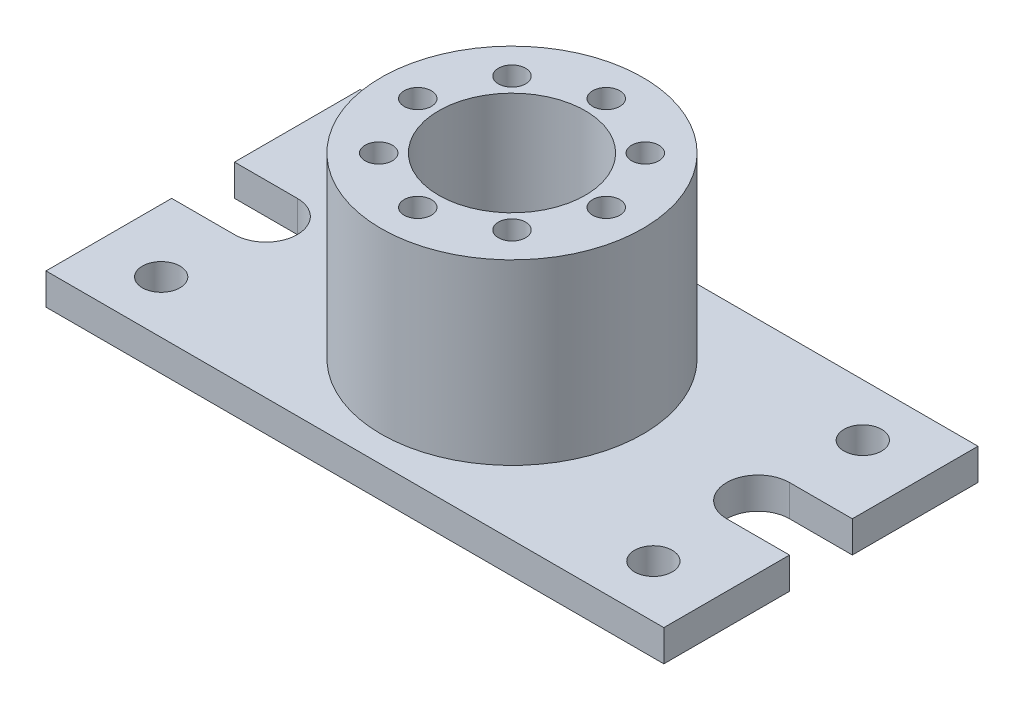
ISO-10303-21;
HEADER;
FILE_DESCRIPTION(('STEP AP214'),'2;1');
FILE_NAME('part.step','',(''),(''),'','','');
FILE_SCHEMA(('AUTOMOTIVE_DESIGN { 1 0 10303 214 1 1 1 1 }'));
ENDSEC;
DATA;
#1=APPLICATION_CONTEXT('core data for automotive mechanical design processes');
#2=APPLICATION_PROTOCOL_DEFINITION('international standard','automotive_design',2000,#1);
#3=PRODUCT_CONTEXT('',#1,'mechanical');
#4=PRODUCT('Part','Part','',(#3));
#5=PRODUCT_RELATED_PRODUCT_CATEGORY('part','',(#4));
#6=PRODUCT_DEFINITION_FORMATION('','',#4);
#7=PRODUCT_DEFINITION_CONTEXT('part definition',#1,'design');
#8=PRODUCT_DEFINITION('design','',#6,#7);
#9=PRODUCT_DEFINITION_SHAPE('','',#8);
#10=(LENGTH_UNIT() NAMED_UNIT(*) SI_UNIT(.MILLI.,.METRE.));
#11=(NAMED_UNIT(*) PLANE_ANGLE_UNIT() SI_UNIT($,.RADIAN.));
#12=(NAMED_UNIT(*) SI_UNIT($,.STERADIAN.) SOLID_ANGLE_UNIT());
#13=UNCERTAINTY_MEASURE_WITH_UNIT(LENGTH_MEASURE(1.E-05),#10,'distance_accuracy_value','');
#14=(GEOMETRIC_REPRESENTATION_CONTEXT(3) GLOBAL_UNCERTAINTY_ASSIGNED_CONTEXT((#13)) GLOBAL_UNIT_ASSIGNED_CONTEXT((#10,
#11,#12)) REPRESENTATION_CONTEXT('',''));
#15=CARTESIAN_POINT('',(0.,0.,0.));
#16=DIRECTION('',(0.,0.,1.));
#17=DIRECTION('',(1.,0.,0.));
#18=AXIS2_PLACEMENT_3D('',#15,#16,#17);
#19=CARTESIAN_POINT('',(0.,15.,14.9999999999998));
#20=DIRECTION('',(0.,0.,-1.));
#21=DIRECTION('',(-1.,0.,0.));
#22=AXIS2_PLACEMENT_3D('',#19,#20,#21);
#23=PLANE('',#22);
#24=DIRECTION('',(1.,0.,0.));
#25=VECTOR('',#24,1.);
#26=CARTESIAN_POINT('',(0.,0.,14.9999999999998));
#27=LINE('',#26,#25);
#28=CARTESIAN_POINT('',(117.5,0.,15.));
#29=VERTEX_POINT('',#28);
#30=CARTESIAN_POINT('',(147.5,0.,15.));
#31=VERTEX_POINT('',#30);
#32=EDGE_CURVE('E168',#29,#31,#27,.T.);
#33=ORIENTED_EDGE('',*,*,#32,.F.);
#34=DIRECTION('',(0.,-1.,0.));
#35=VECTOR('',#34,1.);
#36=CARTESIAN_POINT('',(117.5,15.,15.));
#37=LINE('',#36,#35);
#38=CARTESIAN_POINT('',(117.5,15.,15.));
#39=VERTEX_POINT('',#38);
#40=EDGE_CURVE('E11',#39,#29,#37,.T.);
#41=ORIENTED_EDGE('',*,*,#40,.F.);
#42=DIRECTION('',(1.,0.,0.));
#43=VECTOR('',#42,1.);
#44=CARTESIAN_POINT('',(0.,15.,14.9999999999998));
#45=LINE('',#44,#43);
#46=CARTESIAN_POINT('',(147.5,15.,15.));
#47=VERTEX_POINT('',#46);
#48=EDGE_CURVE('E334',#39,#47,#45,.T.);
#49=ORIENTED_EDGE('',*,*,#48,.T.);
#50=DIRECTION('',(0.,-1.,0.));
#51=VECTOR('',#50,1.);
#52=CARTESIAN_POINT('',(147.5,15.,15.));
#53=LINE('',#52,#51);
#54=EDGE_CURVE('E97',#47,#31,#53,.T.);
#55=ORIENTED_EDGE('',*,*,#54,.T.);
#56=EDGE_LOOP('',(#33,#41,#49,#55));
#57=FACE_BOUND('',#56,.T.);
#58=ADVANCED_FACE('F33',(#57),#23,.T.);
#59=CARTESIAN_POINT('',(117.5,15.,0.));
#60=DIRECTION('',(0.,-1.,0.));
#61=DIRECTION('',(0.,0.,-1.));
#62=AXIS2_PLACEMENT_3D('',#59,#60,#61);
#63=CYLINDRICAL_SURFACE('',#62,15.);
#64=CARTESIAN_POINT('',(117.5,0.,0.));
#65=DIRECTION('',(0.,1.,0.));
#66=DIRECTION('',(0.,0.,1.));
#67=AXIS2_PLACEMENT_3D('',#64,#65,#66);
#68=CIRCLE('',#67,15.);
#69=CARTESIAN_POINT('',(117.5,0.,-15.));
#70=VERTEX_POINT('',#69);
#71=EDGE_CURVE('E170',#29,#70,#68,.F.);
#72=ORIENTED_EDGE('',*,*,#71,.T.);
#73=DIRECTION('',(0.,-1.,0.));
#74=VECTOR('',#73,1.);
#75=CARTESIAN_POINT('',(117.5,15.,-15.));
#76=LINE('',#75,#74);
#77=CARTESIAN_POINT('',(117.5,15.,-15.));
#78=VERTEX_POINT('',#77);
#79=EDGE_CURVE('E42',#78,#70,#76,.T.);
#80=ORIENTED_EDGE('',*,*,#79,.F.);
#81=CARTESIAN_POINT('',(117.5,15.,0.));
#82=DIRECTION('',(0.,1.,0.));
#83=DIRECTION('',(0.,0.,1.));
#84=AXIS2_PLACEMENT_3D('',#81,#82,#83);
#85=CIRCLE('',#84,15.);
#86=EDGE_CURVE('E332',#39,#78,#85,.F.);
#87=ORIENTED_EDGE('',*,*,#86,.F.);
#88=ORIENTED_EDGE('',*,*,#40,.T.);
#89=EDGE_LOOP('',(#72,#80,#87,#88));
#90=FACE_BOUND('',#89,.T.);
#91=ADVANCED_FACE('F222',(#90),#63,.F.);
#92=CARTESIAN_POINT('',(0.,15.,-15.0000000000001));
#93=DIRECTION('',(0.,0.,-1.));
#94=DIRECTION('',(-1.,0.,0.));
#95=AXIS2_PLACEMENT_3D('',#92,#93,#94);
#96=PLANE('',#95);
#97=DIRECTION('',(1.,0.,0.));
#98=VECTOR('',#97,1.);
#99=CARTESIAN_POINT('',(0.,0.,-15.0000000000001));
#100=LINE('',#99,#98);
#101=CARTESIAN_POINT('',(147.5,0.,-15.));
#102=VERTEX_POINT('',#101);
#103=EDGE_CURVE('E173',#70,#102,#100,.T.);
#104=ORIENTED_EDGE('',*,*,#103,.T.);
#105=DIRECTION('',(0.,-1.,0.));
#106=VECTOR('',#105,1.);
#107=CARTESIAN_POINT('',(147.5,15.,-15.));
#108=LINE('',#107,#106);
#109=CARTESIAN_POINT('',(147.5,15.,-15.));
#110=VERTEX_POINT('',#109);
#111=EDGE_CURVE('E210',#110,#102,#108,.T.);
#112=ORIENTED_EDGE('',*,*,#111,.F.);
#113=DIRECTION('',(1.,0.,0.));
#114=VECTOR('',#113,1.);
#115=CARTESIAN_POINT('',(0.,15.,-15.0000000000001));
#116=LINE('',#115,#114);
#117=EDGE_CURVE('E218',#78,#110,#116,.T.);
#118=ORIENTED_EDGE('',*,*,#117,.F.);
#119=ORIENTED_EDGE('',*,*,#79,.T.);
#120=EDGE_LOOP('',(#104,#112,#118,#119));
#121=FACE_BOUND('',#120,.T.);
#122=ADVANCED_FACE('F215',(#121),#96,.F.);
#123=CARTESIAN_POINT('',(147.5,15.,0.));
#124=DIRECTION('',(-1.,0.,0.));
#125=DIRECTION('',(0.,0.,1.));
#126=AXIS2_PLACEMENT_3D('',#123,#124,#125);
#127=PLANE('',#126);
#128=DIRECTION('',(0.,0.,-1.));
#129=VECTOR('',#128,1.);
#130=CARTESIAN_POINT('',(147.5,0.,0.));
#131=LINE('',#130,#129);
#132=CARTESIAN_POINT('',(147.5,0.,-75.));
#133=VERTEX_POINT('',#132);
#134=EDGE_CURVE('E176',#102,#133,#131,.T.);
#135=ORIENTED_EDGE('',*,*,#134,.T.);
#136=DIRECTION('',(0.,-1.,0.));
#137=VECTOR('',#136,1.);
#138=CARTESIAN_POINT('',(147.5,15.,-75.));
#139=LINE('',#138,#137);
#140=CARTESIAN_POINT('',(147.5,15.,-75.));
#141=VERTEX_POINT('',#140);
#142=EDGE_CURVE('E208',#141,#133,#139,.T.);
#143=ORIENTED_EDGE('',*,*,#142,.F.);
#144=DIRECTION('',(0.,0.,-1.));
#145=VECTOR('',#144,1.);
#146=CARTESIAN_POINT('',(147.5,15.,0.));
#147=LINE('',#146,#145);
#148=EDGE_CURVE('E318',#110,#141,#147,.T.);
#149=ORIENTED_EDGE('',*,*,#148,.F.);
#150=ORIENTED_EDGE('',*,*,#111,.T.);
#151=EDGE_LOOP('',(#135,#143,#149,#150));
#152=FACE_BOUND('',#151,.T.);
#153=ADVANCED_FACE('F278',(#152),#127,.F.);
#154=CARTESIAN_POINT('',(0.,15.,-75.));
#155=DIRECTION('',(0.,0.,-1.));
#156=DIRECTION('',(-1.,0.,0.));
#157=AXIS2_PLACEMENT_3D('',#154,#155,#156);
#158=PLANE('',#157);
#159=DIRECTION('',(1.,0.,0.));
#160=VECTOR('',#159,1.);
#161=CARTESIAN_POINT('',(0.,0.,-75.));
#162=LINE('',#161,#160);
#163=CARTESIAN_POINT('',(-147.5,0.,-75.));
#164=VERTEX_POINT('',#163);
#165=EDGE_CURVE('E179',#164,#133,#162,.T.);
#166=ORIENTED_EDGE('',*,*,#165,.F.);
#167=DIRECTION('',(0.,-1.,0.));
#168=VECTOR('',#167,1.);
#169=CARTESIAN_POINT('',(-147.5,15.,-75.));
#170=LINE('',#169,#168);
#171=CARTESIAN_POINT('',(-147.5,15.,-75.));
#172=VERTEX_POINT('',#171);
#173=EDGE_CURVE('E206',#172,#164,#170,.T.);
#174=ORIENTED_EDGE('',*,*,#173,.F.);
#175=DIRECTION('',(1.,0.,0.));
#176=VECTOR('',#175,1.);
#177=CARTESIAN_POINT('',(0.,15.,-75.));
#178=LINE('',#177,#176);
#179=EDGE_CURVE('E314',#172,#141,#178,.T.);
#180=ORIENTED_EDGE('',*,*,#179,.T.);
#181=ORIENTED_EDGE('',*,*,#142,.T.);
#182=EDGE_LOOP('',(#166,#174,#180,#181));
#183=FACE_BOUND('',#182,.T.);
#184=ADVANCED_FACE('F298',(#183),#158,.T.);
#185=CARTESIAN_POINT('',(-147.5,15.,0.));
#186=DIRECTION('',(-1.,0.,0.));
#187=DIRECTION('',(0.,0.,1.));
#188=AXIS2_PLACEMENT_3D('',#185,#186,#187);
#189=PLANE('',#188);
#190=DIRECTION('',(0.,0.,-1.));
#191=VECTOR('',#190,1.);
#192=CARTESIAN_POINT('',(-147.5,0.,0.));
#193=LINE('',#192,#191);
#194=CARTESIAN_POINT('',(-147.5,0.,-15.));
#195=VERTEX_POINT('',#194);
#196=EDGE_CURVE('E182',#195,#164,#193,.T.);
#197=ORIENTED_EDGE('',*,*,#196,.F.);
#198=DIRECTION('',(0.,-1.,0.));
#199=VECTOR('',#198,1.);
#200=CARTESIAN_POINT('',(-147.5,15.,-15.));
#201=LINE('',#200,#199);
#202=CARTESIAN_POINT('',(-147.5,15.,-15.));
#203=VERTEX_POINT('',#202);
#204=EDGE_CURVE('E204',#203,#195,#201,.T.);
#205=ORIENTED_EDGE('',*,*,#204,.F.);
#206=DIRECTION('',(0.,0.,-1.));
#207=VECTOR('',#206,1.);
#208=CARTESIAN_POINT('',(-147.5,15.,0.));
#209=LINE('',#208,#207);
#210=EDGE_CURVE('E317',#203,#172,#209,.T.);
#211=ORIENTED_EDGE('',*,*,#210,.T.);
#212=ORIENTED_EDGE('',*,*,#173,.T.);
#213=EDGE_LOOP('',(#197,#205,#211,#212));
#214=FACE_BOUND('',#213,.T.);
#215=ADVANCED_FACE('F294',(#214),#189,.T.);
#216=CARTESIAN_POINT('',(0.,15.,-15.));
#217=DIRECTION('',(0.,0.,1.));
#218=DIRECTION('',(1.,0.,0.));
#219=AXIS2_PLACEMENT_3D('',#216,#217,#218);
#220=PLANE('',#219);
#221=DIRECTION('',(-1.,0.,0.));
#222=VECTOR('',#221,1.);
#223=CARTESIAN_POINT('',(0.,0.,-15.));
#224=LINE('',#223,#222);
#225=CARTESIAN_POINT('',(-117.5,0.,-15.));
#226=VERTEX_POINT('',#225);
#227=EDGE_CURVE('E185',#226,#195,#224,.T.);
#228=ORIENTED_EDGE('',*,*,#227,.F.);
#229=DIRECTION('',(0.,-1.,0.));
#230=VECTOR('',#229,1.);
#231=CARTESIAN_POINT('',(-117.5,15.,-15.));
#232=LINE('',#231,#230);
#233=CARTESIAN_POINT('',(-117.5,15.,-15.));
#234=VERTEX_POINT('',#233);
#235=EDGE_CURVE('E202',#234,#226,#232,.T.);
#236=ORIENTED_EDGE('',*,*,#235,.F.);
#237=DIRECTION('',(-1.,0.,0.));
#238=VECTOR('',#237,1.);
#239=CARTESIAN_POINT('',(0.,15.,-15.));
#240=LINE('',#239,#238);
#241=EDGE_CURVE('E320',#234,#203,#240,.T.);
#242=ORIENTED_EDGE('',*,*,#241,.T.);
#243=ORIENTED_EDGE('',*,*,#204,.T.);
#244=EDGE_LOOP('',(#228,#236,#242,#243));
#245=FACE_BOUND('',#244,.T.);
#246=ADVANCED_FACE('F290',(#245),#220,.T.);
#247=CARTESIAN_POINT('',(-117.5,15.,0.));
#248=DIRECTION('',(0.,-1.,0.));
#249=DIRECTION('',(0.,0.,-1.));
#250=AXIS2_PLACEMENT_3D('',#247,#248,#249);
#251=CYLINDRICAL_SURFACE('',#250,15.);
#252=CARTESIAN_POINT('',(-117.5,0.,0.));
#253=DIRECTION('',(0.,1.,0.));
#254=DIRECTION('',(0.,0.,1.));
#255=AXIS2_PLACEMENT_3D('',#252,#253,#254);
#256=CIRCLE('',#255,15.);
#257=CARTESIAN_POINT('',(-117.5,0.,15.));
#258=VERTEX_POINT('',#257);
#259=EDGE_CURVE('E188',#258,#226,#256,.T.);
#260=ORIENTED_EDGE('',*,*,#259,.F.);
#261=DIRECTION('',(0.,-1.,0.));
#262=VECTOR('',#261,1.);
#263=CARTESIAN_POINT('',(-117.5,15.,15.));
#264=LINE('',#263,#262);
#265=CARTESIAN_POINT('',(-117.5,15.,15.));
#266=VERTEX_POINT('',#265);
#267=EDGE_CURVE('E200',#266,#258,#264,.T.);
#268=ORIENTED_EDGE('',*,*,#267,.F.);
#269=CARTESIAN_POINT('',(-117.5,15.,0.));
#270=DIRECTION('',(0.,1.,0.));
#271=DIRECTION('',(0.,0.,1.));
#272=AXIS2_PLACEMENT_3D('',#269,#270,#271);
#273=CIRCLE('',#272,15.);
#274=EDGE_CURVE('E151',#266,#234,#273,.T.);
#275=ORIENTED_EDGE('',*,*,#274,.T.);
#276=ORIENTED_EDGE('',*,*,#235,.T.);
#277=EDGE_LOOP('',(#260,#268,#275,#276));
#278=FACE_BOUND('',#277,.T.);
#279=ADVANCED_FACE('F286',(#278),#251,.F.);
#280=CARTESIAN_POINT('',(0.,15.,15.));
#281=DIRECTION('',(0.,0.,1.));
#282=DIRECTION('',(1.,0.,0.));
#283=AXIS2_PLACEMENT_3D('',#280,#281,#282);
#284=PLANE('',#283);
#285=DIRECTION('',(-1.,0.,0.));
#286=VECTOR('',#285,1.);
#287=CARTESIAN_POINT('',(0.,0.,15.));
#288=LINE('',#287,#286);
#289=CARTESIAN_POINT('',(-147.5,0.,15.));
#290=VERTEX_POINT('',#289);
#291=EDGE_CURVE('E191',#258,#290,#288,.T.);
#292=ORIENTED_EDGE('',*,*,#291,.T.);
#293=DIRECTION('',(0.,-1.,0.));
#294=VECTOR('',#293,1.);
#295=CARTESIAN_POINT('',(-147.5,15.,15.));
#296=LINE('',#295,#294);
#297=CARTESIAN_POINT('',(-147.5,15.,15.));
#298=VERTEX_POINT('',#297);
#299=EDGE_CURVE('E138',#298,#290,#296,.T.);
#300=ORIENTED_EDGE('',*,*,#299,.F.);
#301=DIRECTION('',(-1.,0.,0.));
#302=VECTOR('',#301,1.);
#303=CARTESIAN_POINT('',(0.,15.,15.));
#304=LINE('',#303,#302);
#305=EDGE_CURVE('E148',#266,#298,#304,.T.);
#306=ORIENTED_EDGE('',*,*,#305,.F.);
#307=ORIENTED_EDGE('',*,*,#267,.T.);
#308=EDGE_LOOP('',(#292,#300,#306,#307));
#309=FACE_BOUND('',#308,.T.);
#310=ADVANCED_FACE('F283',(#309),#284,.F.);
#311=CARTESIAN_POINT('',(-147.5,15.,0.));
#312=DIRECTION('',(-1.,0.,0.));
#313=DIRECTION('',(0.,0.,1.));
#314=AXIS2_PLACEMENT_3D('',#311,#312,#313);
#315=PLANE('',#314);
#316=DIRECTION('',(0.,0.,-1.));
#317=VECTOR('',#316,1.);
#318=CARTESIAN_POINT('',(-147.5,0.,0.));
#319=LINE('',#318,#317);
#320=CARTESIAN_POINT('',(-147.5,0.,75.));
#321=VERTEX_POINT('',#320);
#322=EDGE_CURVE('E135',#321,#290,#319,.T.);
#323=ORIENTED_EDGE('',*,*,#322,.F.);
#324=DIRECTION('',(0.,-1.,0.));
#325=VECTOR('',#324,1.);
#326=CARTESIAN_POINT('',(-147.5,15.,75.));
#327=LINE('',#326,#325);
#328=CARTESIAN_POINT('',(-147.5,15.,75.));
#329=VERTEX_POINT('',#328);
#330=EDGE_CURVE('E129',#329,#321,#327,.T.);
#331=ORIENTED_EDGE('',*,*,#330,.F.);
#332=DIRECTION('',(0.,0.,-1.));
#333=VECTOR('',#332,1.);
#334=CARTESIAN_POINT('',(-147.5,15.,0.));
#335=LINE('',#334,#333);
#336=EDGE_CURVE('E133',#329,#298,#335,.T.);
#337=ORIENTED_EDGE('',*,*,#336,.T.);
#338=ORIENTED_EDGE('',*,*,#299,.T.);
#339=EDGE_LOOP('',(#323,#331,#337,#338));
#340=FACE_BOUND('',#339,.T.);
#341=ADVANCED_FACE('F131',(#340),#315,.T.);
#342=CARTESIAN_POINT('',(0.,15.,75.));
#343=DIRECTION('',(0.,0.,-1.));
#344=DIRECTION('',(-1.,0.,0.));
#345=AXIS2_PLACEMENT_3D('',#342,#343,#344);
#346=PLANE('',#345);
#347=DIRECTION('',(1.,0.,0.));
#348=VECTOR('',#347,1.);
#349=CARTESIAN_POINT('',(0.,0.,75.));
#350=LINE('',#349,#348);
#351=CARTESIAN_POINT('',(147.5,0.,75.));
#352=VERTEX_POINT('',#351);
#353=EDGE_CURVE('E195',#321,#352,#350,.T.);
#354=ORIENTED_EDGE('',*,*,#353,.T.);
#355=DIRECTION('',(0.,-1.,0.));
#356=VECTOR('',#355,1.);
#357=CARTESIAN_POINT('',(147.5,15.,75.));
#358=LINE('',#357,#356);
#359=CARTESIAN_POINT('',(147.5,15.,75.));
#360=VERTEX_POINT('',#359);
#361=EDGE_CURVE('E139',#360,#352,#358,.T.);
#362=ORIENTED_EDGE('',*,*,#361,.F.);
#363=DIRECTION('',(1.,0.,0.));
#364=VECTOR('',#363,1.);
#365=CARTESIAN_POINT('',(0.,15.,75.));
#366=LINE('',#365,#364);
#367=EDGE_CURVE('E142',#329,#360,#366,.T.);
#368=ORIENTED_EDGE('',*,*,#367,.F.);
#369=ORIENTED_EDGE('',*,*,#330,.T.);
#370=EDGE_LOOP('',(#354,#362,#368,#369));
#371=FACE_BOUND('',#370,.T.);
#372=ADVANCED_FACE('F143',(#371),#346,.F.);
#373=CARTESIAN_POINT('',(-117.5,15.,50.));
#374=DIRECTION('',(0.,-1.,0.));
#375=DIRECTION('',(0.,0.,-1.));
#376=AXIS2_PLACEMENT_3D('',#373,#374,#375);
#377=CYLINDRICAL_SURFACE('',#376,9.);
#378=CARTESIAN_POINT('',(-117.5,15.,50.));
#379=DIRECTION('',(0.,1.,0.));
#380=DIRECTION('',(0.,0.,1.));
#381=AXIS2_PLACEMENT_3D('',#378,#379,#380);
#382=CIRCLE('',#381,9.);
#383=CARTESIAN_POINT('',(-117.5,15.,59.));
#384=VERTEX_POINT('',#383);
#385=EDGE_CURVE('E336',#384,#384,#382,.F.);
#386=ORIENTED_EDGE('',*,*,#385,.F.);
#387=EDGE_LOOP('',(#386));
#388=FACE_BOUND('',#387,.T.);
#389=CARTESIAN_POINT('',(-117.5,0.,50.));
#390=DIRECTION('',(0.,1.,0.));
#391=DIRECTION('',(0.,0.,1.));
#392=AXIS2_PLACEMENT_3D('',#389,#390,#391);
#393=CIRCLE('',#392,9.);
#394=CARTESIAN_POINT('',(-117.5,0.,59.));
#395=VERTEX_POINT('',#394);
#396=EDGE_CURVE('E165',#395,#395,#393,.F.);
#397=ORIENTED_EDGE('',*,*,#396,.T.);
#398=EDGE_LOOP('',(#397));
#399=FACE_BOUND('',#398,.T.);
#400=ADVANCED_FACE('F232',(#388,#399),#377,.F.);
#401=CARTESIAN_POINT('',(117.5,15.,50.));
#402=DIRECTION('',(0.,-1.,0.));
#403=DIRECTION('',(0.,0.,-1.));
#404=AXIS2_PLACEMENT_3D('',#401,#402,#403);
#405=CYLINDRICAL_SURFACE('',#404,9.00000000000001);
#406=CARTESIAN_POINT('',(117.5,15.,50.));
#407=DIRECTION('',(0.,1.,0.));
#408=DIRECTION('',(0.,0.,1.));
#409=AXIS2_PLACEMENT_3D('',#406,#407,#408);
#410=CIRCLE('',#409,9.00000000000001);
#411=CARTESIAN_POINT('',(117.5,15.,59.));
#412=VERTEX_POINT('',#411);
#413=EDGE_CURVE('E339',#412,#412,#410,.T.);
#414=ORIENTED_EDGE('',*,*,#413,.T.);
#415=EDGE_LOOP('',(#414));
#416=FACE_BOUND('',#415,.T.);
#417=CARTESIAN_POINT('',(117.5,0.,50.));
#418=DIRECTION('',(0.,1.,0.));
#419=DIRECTION('',(0.,0.,1.));
#420=AXIS2_PLACEMENT_3D('',#417,#418,#419);
#421=CIRCLE('',#420,9.00000000000001);
#422=CARTESIAN_POINT('',(117.5,0.,59.));
#423=VERTEX_POINT('',#422);
#424=EDGE_CURVE('E162',#423,#423,#421,.T.);
#425=ORIENTED_EDGE('',*,*,#424,.F.);
#426=EDGE_LOOP('',(#425));
#427=FACE_BOUND('',#426,.T.);
#428=ADVANCED_FACE('F235',(#416,#427),#405,.F.);
#429=CARTESIAN_POINT('',(-117.5,15.,-50.));
#430=DIRECTION('',(0.,-1.,0.));
#431=DIRECTION('',(0.,0.,-1.));
#432=AXIS2_PLACEMENT_3D('',#429,#430,#431);
#433=CYLINDRICAL_SURFACE('',#432,9.);
#434=CARTESIAN_POINT('',(-117.5,15.,-50.));
#435=DIRECTION('',(0.,1.,0.));
#436=DIRECTION('',(0.,0.,1.));
#437=AXIS2_PLACEMENT_3D('',#434,#435,#436);
#438=CIRCLE('',#437,9.);
#439=CARTESIAN_POINT('',(-117.5,15.,-41.));
#440=VERTEX_POINT('',#439);
#441=EDGE_CURVE('E250',#440,#440,#438,.T.);
#442=ORIENTED_EDGE('',*,*,#441,.T.);
#443=EDGE_LOOP('',(#442));
#444=FACE_BOUND('',#443,.T.);
#445=CARTESIAN_POINT('',(-117.5,0.,-50.));
#446=DIRECTION('',(0.,1.,0.));
#447=DIRECTION('',(0.,0.,1.));
#448=AXIS2_PLACEMENT_3D('',#445,#446,#447);
#449=CIRCLE('',#448,9.);
#450=CARTESIAN_POINT('',(-117.5,0.,-41.));
#451=VERTEX_POINT('',#450);
#452=EDGE_CURVE('E158',#451,#451,#449,.T.);
#453=ORIENTED_EDGE('',*,*,#452,.F.);
#454=EDGE_LOOP('',(#453));
#455=FACE_BOUND('',#454,.T.);
#456=ADVANCED_FACE('F238',(#444,#455),#433,.F.);
#457=CARTESIAN_POINT('',(117.5,15.,-50.));
#458=DIRECTION('',(0.,-1.,0.));
#459=DIRECTION('',(0.,0.,-1.));
#460=AXIS2_PLACEMENT_3D('',#457,#458,#459);
#461=CYLINDRICAL_SURFACE('',#460,9.00000000000001);
#462=CARTESIAN_POINT('',(117.5,15.,-50.));
#463=DIRECTION('',(0.,1.,0.));
#464=DIRECTION('',(0.,0.,1.));
#465=AXIS2_PLACEMENT_3D('',#462,#463,#464);
#466=CIRCLE('',#465,9.00000000000001);
#467=CARTESIAN_POINT('',(117.5,15.,-41.));
#468=VERTEX_POINT('',#467);
#469=EDGE_CURVE('E343',#468,#468,#466,.F.);
#470=ORIENTED_EDGE('',*,*,#469,.F.);
#471=EDGE_LOOP('',(#470));
#472=FACE_BOUND('',#471,.T.);
#473=CARTESIAN_POINT('',(117.5,0.,-50.));
#474=DIRECTION('',(0.,1.,0.));
#475=DIRECTION('',(0.,0.,1.));
#476=AXIS2_PLACEMENT_3D('',#473,#474,#475);
#477=CIRCLE('',#476,9.00000000000001);
#478=CARTESIAN_POINT('',(117.5,0.,-41.));
#479=VERTEX_POINT('',#478);
#480=EDGE_CURVE('E155',#479,#479,#477,.F.);
#481=ORIENTED_EDGE('',*,*,#480,.T.);
#482=EDGE_LOOP('',(#481));
#483=FACE_BOUND('',#482,.T.);
#484=ADVANCED_FACE('F35',(#472,#483),#461,.F.);
#485=EDGE_CURVE('E90',#352,#31,#131,.T.);
#486=ORIENTED_EDGE('',*,*,#485,.T.);
#487=ORIENTED_EDGE('',*,*,#54,.F.);
#488=EDGE_CURVE('E50',#360,#47,#147,.T.);
#489=ORIENTED_EDGE('',*,*,#488,.F.);
#490=ORIENTED_EDGE('',*,*,#361,.T.);
#491=EDGE_LOOP('',(#486,#487,#489,#490));
#492=FACE_BOUND('',#491,.T.);
#493=ADVANCED_FACE('F245',(#492),#127,.F.);
#494=CARTESIAN_POINT('',(0.,15.,0.));
#495=DIRECTION('',(0.,1.,0.));
#496=DIRECTION('',(0.,0.,1.));
#497=AXIS2_PLACEMENT_3D('',#494,#495,#496);
#498=PLANE('',#497);
#499=CARTESIAN_POINT('',(0.,15.,0.));
#500=DIRECTION('',(0.,1.,0.));
#501=DIRECTION('',(0.,0.,1.));
#502=AXIS2_PLACEMENT_3D('',#499,#500,#501);
#503=CIRCLE('',#502,62.5);
#504=CARTESIAN_POINT('',(0.,15.,62.5));
#505=VERTEX_POINT('',#504);
#506=EDGE_CURVE('E346',#505,#505,#503,.T.);
#507=ORIENTED_EDGE('',*,*,#506,.F.);
#508=EDGE_LOOP('',(#507));
#509=FACE_BOUND('',#508,.T.);
#510=ORIENTED_EDGE('',*,*,#469,.T.);
#511=EDGE_LOOP('',(#510));
#512=FACE_BOUND('',#511,.T.);
#513=ORIENTED_EDGE('',*,*,#441,.F.);
#514=EDGE_LOOP('',(#513));
#515=FACE_BOUND('',#514,.T.);
#516=ORIENTED_EDGE('',*,*,#413,.F.);
#517=EDGE_LOOP('',(#516));
#518=FACE_BOUND('',#517,.T.);
#519=ORIENTED_EDGE('',*,*,#385,.T.);
#520=EDGE_LOOP('',(#519));
#521=FACE_BOUND('',#520,.T.);
#522=ORIENTED_EDGE('',*,*,#48,.F.);
#523=ORIENTED_EDGE('',*,*,#86,.T.);
#524=ORIENTED_EDGE('',*,*,#117,.T.);
#525=ORIENTED_EDGE('',*,*,#148,.T.);
#526=ORIENTED_EDGE('',*,*,#179,.F.);
#527=ORIENTED_EDGE('',*,*,#210,.F.);
#528=ORIENTED_EDGE('',*,*,#241,.F.);
#529=ORIENTED_EDGE('',*,*,#274,.F.);
#530=ORIENTED_EDGE('',*,*,#305,.T.);
#531=ORIENTED_EDGE('',*,*,#336,.F.);
#532=ORIENTED_EDGE('',*,*,#367,.T.);
#533=ORIENTED_EDGE('',*,*,#488,.T.);
#534=EDGE_LOOP('',(#522,#523,#524,#525,#526,#527,#528,#529,#530,#531,#532,#533));
#535=FACE_BOUND('',#534,.T.);
#536=ADVANCED_FACE('F145',(#509,#512,#515,#518,#521,#535),#498,.T.);
#537=CARTESIAN_POINT('',(0.,0.,0.));
#538=DIRECTION('',(0.,1.,0.));
#539=DIRECTION('',(0.,0.,1.));
#540=AXIS2_PLACEMENT_3D('',#537,#538,#539);
#541=PLANE('',#540);
#542=CARTESIAN_POINT('',(0.,0.,0.));
#543=DIRECTION('',(0.,1.,0.));
#544=DIRECTION('',(0.,0.,1.));
#545=AXIS2_PLACEMENT_3D('',#542,#543,#544);
#546=CIRCLE('',#545,35.);
#547=CARTESIAN_POINT('',(0.,0.,35.));
#548=VERTEX_POINT('',#547);
#549=EDGE_CURVE('E349',#548,#548,#546,.T.);
#550=ORIENTED_EDGE('',*,*,#549,.T.);
#551=EDGE_LOOP('',(#550));
#552=FACE_BOUND('',#551,.T.);
#553=ORIENTED_EDGE('',*,*,#480,.F.);
#554=EDGE_LOOP('',(#553));
#555=FACE_BOUND('',#554,.T.);
#556=ORIENTED_EDGE('',*,*,#452,.T.);
#557=EDGE_LOOP('',(#556));
#558=FACE_BOUND('',#557,.T.);
#559=ORIENTED_EDGE('',*,*,#424,.T.);
#560=EDGE_LOOP('',(#559));
#561=FACE_BOUND('',#560,.T.);
#562=ORIENTED_EDGE('',*,*,#396,.F.);
#563=EDGE_LOOP('',(#562));
#564=FACE_BOUND('',#563,.T.);
#565=ORIENTED_EDGE('',*,*,#32,.T.);
#566=ORIENTED_EDGE('',*,*,#485,.F.);
#567=ORIENTED_EDGE('',*,*,#353,.F.);
#568=ORIENTED_EDGE('',*,*,#322,.T.);
#569=ORIENTED_EDGE('',*,*,#291,.F.);
#570=ORIENTED_EDGE('',*,*,#259,.T.);
#571=ORIENTED_EDGE('',*,*,#227,.T.);
#572=ORIENTED_EDGE('',*,*,#196,.T.);
#573=ORIENTED_EDGE('',*,*,#165,.T.);
#574=ORIENTED_EDGE('',*,*,#134,.F.);
#575=ORIENTED_EDGE('',*,*,#103,.F.);
#576=ORIENTED_EDGE('',*,*,#71,.F.);
#577=EDGE_LOOP('',(#565,#566,#567,#568,#569,#570,#571,#572,#573,#574,#575,#576));
#578=FACE_BOUND('',#577,.T.);
#579=ADVANCED_FACE('F223',(#552,#555,#558,#561,#564,#578),#541,.F.);
#580=CARTESIAN_POINT('',(0.,100.,0.));
#581=DIRECTION('',(0.,-1.,0.));
#582=DIRECTION('',(0.,0.,-1.));
#583=AXIS2_PLACEMENT_3D('',#580,#581,#582);
#584=CYLINDRICAL_SURFACE('',#583,62.5);
#585=CARTESIAN_POINT('',(0.,100.,0.));
#586=DIRECTION('',(0.,1.,0.));
#587=DIRECTION('',(0.,0.,1.));
#588=AXIS2_PLACEMENT_3D('',#585,#586,#587);
#589=CIRCLE('',#588,62.5);
#590=CARTESIAN_POINT('',(0.,100.,62.5));
#591=VERTEX_POINT('',#590);
#592=EDGE_CURVE('E159',#591,#591,#589,.T.);
#593=ORIENTED_EDGE('',*,*,#592,.F.);
#594=EDGE_LOOP('',(#593));
#595=FACE_BOUND('',#594,.T.);
#596=ORIENTED_EDGE('',*,*,#506,.T.);
#597=EDGE_LOOP('',(#596));
#598=FACE_BOUND('',#597,.T.);
#599=ADVANCED_FACE('F255',(#595,#598),#584,.T.);
#600=CARTESIAN_POINT('',(0.,100.,0.));
#601=DIRECTION('',(0.,1.,0.));
#602=DIRECTION('',(0.,0.,1.));
#603=AXIS2_PLACEMENT_3D('',#600,#601,#602);
#604=PLANE('',#603);
#605=CARTESIAN_POINT('',(-31.8198051533946,100.,-31.8198051533947));
#606=DIRECTION('',(0.,1.,0.));
#607=DIRECTION('',(0.,0.,1.));
#608=AXIS2_PLACEMENT_3D('',#605,#606,#607);
#609=CIRCLE('',#608,6.5);
#610=CARTESIAN_POINT('',(-31.8198051533946,100.,-25.3198051533947));
#611=VERTEX_POINT('',#610);
#612=EDGE_CURVE('E399',#611,#611,#609,.T.);
#613=ORIENTED_EDGE('',*,*,#612,.F.);
#614=EDGE_LOOP('',(#613));
#615=FACE_BOUND('',#614,.T.);
#616=CARTESIAN_POINT('',(1.57116660247941E-13,100.,-45.));
#617=DIRECTION('',(0.,1.,0.));
#618=DIRECTION('',(0.,0.,1.));
#619=AXIS2_PLACEMENT_3D('',#616,#617,#618);
#620=CIRCLE('',#619,6.5);
#621=CARTESIAN_POINT('',(1.57116660247941E-13,100.,-38.5));
#622=VERTEX_POINT('',#621);
#623=EDGE_CURVE('E393',#622,#622,#620,.T.);
#624=ORIENTED_EDGE('',*,*,#623,.F.);
#625=EDGE_LOOP('',(#624));
#626=FACE_BOUND('',#625,.T.);
#627=CARTESIAN_POINT('',(31.8198051533948,100.,-31.8198051533945));
#628=DIRECTION('',(0.,1.,0.));
#629=DIRECTION('',(0.,0.,1.));
#630=AXIS2_PLACEMENT_3D('',#627,#628,#629);
#631=CIRCLE('',#630,6.5);
#632=CARTESIAN_POINT('',(31.8198051533948,100.,-25.3198051533945));
#633=VERTEX_POINT('',#632);
#634=EDGE_CURVE('E387',#633,#633,#631,.T.);
#635=ORIENTED_EDGE('',*,*,#634,.F.);
#636=EDGE_LOOP('',(#635));
#637=FACE_BOUND('',#636,.T.);
#638=CARTESIAN_POINT('',(45.,100.,3.14233320495882E-13));
#639=DIRECTION('',(0.,1.,0.));
#640=DIRECTION('',(0.,0.,1.));
#641=AXIS2_PLACEMENT_3D('',#638,#639,#640);
#642=CIRCLE('',#641,6.5);
#643=CARTESIAN_POINT('',(45.,100.,6.50000000000032));
#644=VERTEX_POINT('',#643);
#645=EDGE_CURVE('E381',#644,#644,#642,.T.);
#646=ORIENTED_EDGE('',*,*,#645,.F.);
#647=EDGE_LOOP('',(#646));
#648=FACE_BOUND('',#647,.T.);
#649=CARTESIAN_POINT('',(31.8198051533944,100.,31.8198051533949));
#650=DIRECTION('',(0.,1.,0.));
#651=DIRECTION('',(0.,0.,1.));
#652=AXIS2_PLACEMENT_3D('',#649,#650,#651);
#653=CIRCLE('',#652,6.50000000000001);
#654=CARTESIAN_POINT('',(31.8198051533944,100.,38.3198051533949));
#655=VERTEX_POINT('',#654);
#656=EDGE_CURVE('E375',#655,#655,#653,.T.);
#657=ORIENTED_EDGE('',*,*,#656,.F.);
#658=EDGE_LOOP('',(#657));
#659=FACE_BOUND('',#658,.T.);
#660=CARTESIAN_POINT('',(-4.71349980743823E-13,100.,45.));
#661=DIRECTION('',(0.,1.,0.));
#662=DIRECTION('',(0.,0.,1.));
#663=AXIS2_PLACEMENT_3D('',#660,#661,#662);
#664=CIRCLE('',#663,6.5);
#665=CARTESIAN_POINT('',(-4.71349980743823E-13,100.,51.5));
#666=VERTEX_POINT('',#665);
#667=EDGE_CURVE('E369',#666,#666,#664,.T.);
#668=ORIENTED_EDGE('',*,*,#667,.F.);
#669=EDGE_LOOP('',(#668));
#670=FACE_BOUND('',#669,.T.);
#671=CARTESIAN_POINT('',(-31.819805153395,100.,31.8198051533942));
#672=DIRECTION('',(0.,1.,0.));
#673=DIRECTION('',(0.,0.,1.));
#674=AXIS2_PLACEMENT_3D('',#671,#672,#673);
#675=CIRCLE('',#674,6.5);
#676=CARTESIAN_POINT('',(-31.819805153395,100.,38.3198051533942));
#677=VERTEX_POINT('',#676);
#678=EDGE_CURVE('E363',#677,#677,#675,.T.);
#679=ORIENTED_EDGE('',*,*,#678,.F.);
#680=EDGE_LOOP('',(#679));
#681=FACE_BOUND('',#680,.T.);
#682=CARTESIAN_POINT('',(-45.,100.,0.));
#683=DIRECTION('',(0.,1.,0.));
#684=DIRECTION('',(0.,0.,1.));
#685=AXIS2_PLACEMENT_3D('',#682,#683,#684);
#686=CIRCLE('',#685,6.5);
#687=CARTESIAN_POINT('',(-45.,100.,6.5));
#688=VERTEX_POINT('',#687);
#689=EDGE_CURVE('E357',#688,#688,#686,.T.);
#690=ORIENTED_EDGE('',*,*,#689,.F.);
#691=EDGE_LOOP('',(#690));
#692=FACE_BOUND('',#691,.T.);
#693=CARTESIAN_POINT('',(0.,100.,0.));
#694=DIRECTION('',(0.,1.,0.));
#695=DIRECTION('',(0.,0.,1.));
#696=AXIS2_PLACEMENT_3D('',#693,#694,#695);
#697=CIRCLE('',#696,35.);
#698=CARTESIAN_POINT('',(0.,100.,35.));
#699=VERTEX_POINT('',#698);
#700=EDGE_CURVE('E352',#699,#699,#697,.T.);
#701=ORIENTED_EDGE('',*,*,#700,.F.);
#702=EDGE_LOOP('',(#701));
#703=FACE_BOUND('',#702,.T.);
#704=ORIENTED_EDGE('',*,*,#592,.T.);
#705=EDGE_LOOP('',(#704));
#706=FACE_BOUND('',#705,.T.);
#707=ADVANCED_FACE('F267',(#615,#626,#637,#648,#659,#670,#681,#692,#703,#706),#604,.T.);
#708=CARTESIAN_POINT('',(0.,0.,0.));
#709=DIRECTION('',(0.,1.,0.));
#710=DIRECTION('',(0.,0.,1.));
#711=AXIS2_PLACEMENT_3D('',#708,#709,#710);
#712=CYLINDRICAL_SURFACE('',#711,35.);
#713=ORIENTED_EDGE('',*,*,#549,.F.);
#714=EDGE_LOOP('',(#713));
#715=FACE_BOUND('',#714,.T.);
#716=ORIENTED_EDGE('',*,*,#700,.T.);
#717=EDGE_LOOP('',(#716));
#718=FACE_BOUND('',#717,.T.);
#719=ADVANCED_FACE('F416',(#715,#718),#712,.F.);
#720=CARTESIAN_POINT('',(-45.,50.,0.));
#721=DIRECTION('',(0.,1.,0.));
#722=DIRECTION('',(0.,0.,1.));
#723=AXIS2_PLACEMENT_3D('',#720,#721,#722);
#724=CYLINDRICAL_SURFACE('',#723,6.5);
#725=CARTESIAN_POINT('',(-45.,50.,0.));
#726=DIRECTION('',(0.,1.,0.));
#727=DIRECTION('',(0.,0.,1.));
#728=AXIS2_PLACEMENT_3D('',#725,#726,#727);
#729=CIRCLE('',#728,6.5);
#730=CARTESIAN_POINT('',(-45.,50.,6.5));
#731=VERTEX_POINT('',#730);
#732=EDGE_CURVE('E355',#731,#731,#729,.T.);
#733=ORIENTED_EDGE('',*,*,#732,.F.);
#734=EDGE_LOOP('',(#733));
#735=FACE_BOUND('',#734,.T.);
#736=ORIENTED_EDGE('',*,*,#689,.T.);
#737=EDGE_LOOP('',(#736));
#738=FACE_BOUND('',#737,.T.);
#739=ADVANCED_FACE('F448',(#735,#738),#724,.F.);
#740=CARTESIAN_POINT('',(-45.,50.,0.));
#741=DIRECTION('',(0.,1.,0.));
#742=DIRECTION('',(0.,0.,1.));
#743=AXIS2_PLACEMENT_3D('',#740,#741,#742);
#744=PLANE('',#743);
#745=ORIENTED_EDGE('',*,*,#732,.T.);
#746=EDGE_LOOP('',(#745));
#747=FACE_BOUND('',#746,.T.);
#748=ADVANCED_FACE('F454',(#747),#744,.T.);
#749=CARTESIAN_POINT('',(-31.819805153395,50.,31.8198051533942));
#750=DIRECTION('',(0.,1.,0.));
#751=DIRECTION('',(0.,0.,1.));
#752=AXIS2_PLACEMENT_3D('',#749,#750,#751);
#753=CYLINDRICAL_SURFACE('',#752,6.5);
#754=CARTESIAN_POINT('',(-31.819805153395,50.,31.8198051533942));
#755=DIRECTION('',(0.,1.,0.));
#756=DIRECTION('',(0.,0.,1.));
#757=AXIS2_PLACEMENT_3D('',#754,#755,#756);
#758=CIRCLE('',#757,6.5);
#759=CARTESIAN_POINT('',(-31.819805153395,50.,38.3198051533942));
#760=VERTEX_POINT('',#759);
#761=EDGE_CURVE('E366',#760,#760,#758,.T.);
#762=ORIENTED_EDGE('',*,*,#761,.F.);
#763=EDGE_LOOP('',(#762));
#764=FACE_BOUND('',#763,.T.);
#765=ORIENTED_EDGE('',*,*,#678,.T.);
#766=EDGE_LOOP('',(#765));
#767=FACE_BOUND('',#766,.T.);
#768=ADVANCED_FACE('F461',(#764,#767),#753,.F.);
#769=CARTESIAN_POINT('',(-31.819805153395,50.,31.8198051533942));
#770=DIRECTION('',(0.,1.,0.));
#771=DIRECTION('',(0.,0.,1.));
#772=AXIS2_PLACEMENT_3D('',#769,#770,#771);
#773=PLANE('',#772);
#774=ORIENTED_EDGE('',*,*,#761,.T.);
#775=EDGE_LOOP('',(#774));
#776=FACE_BOUND('',#775,.T.);
#777=ADVANCED_FACE('F465',(#776),#773,.T.);
#778=CARTESIAN_POINT('',(-4.71349980743823E-13,50.,45.));
#779=DIRECTION('',(0.,1.,0.));
#780=DIRECTION('',(0.,0.,1.));
#781=AXIS2_PLACEMENT_3D('',#778,#779,#780);
#782=CYLINDRICAL_SURFACE('',#781,6.5);
#783=CARTESIAN_POINT('',(-4.71349980743823E-13,50.,45.));
#784=DIRECTION('',(0.,1.,0.));
#785=DIRECTION('',(0.,0.,1.));
#786=AXIS2_PLACEMENT_3D('',#783,#784,#785);
#787=CIRCLE('',#786,6.5);
#788=CARTESIAN_POINT('',(-4.71349980743823E-13,50.,51.5));
#789=VERTEX_POINT('',#788);
#790=EDGE_CURVE('E372',#789,#789,#787,.T.);
#791=ORIENTED_EDGE('',*,*,#790,.F.);
#792=EDGE_LOOP('',(#791));
#793=FACE_BOUND('',#792,.T.);
#794=ORIENTED_EDGE('',*,*,#667,.T.);
#795=EDGE_LOOP('',(#794));
#796=FACE_BOUND('',#795,.T.);
#797=ADVANCED_FACE('F469',(#793,#796),#782,.F.);
#798=CARTESIAN_POINT('',(-4.71349980743823E-13,50.,45.));
#799=DIRECTION('',(0.,1.,0.));
#800=DIRECTION('',(0.,0.,1.));
#801=AXIS2_PLACEMENT_3D('',#798,#799,#800);
#802=PLANE('',#801);
#803=ORIENTED_EDGE('',*,*,#790,.T.);
#804=EDGE_LOOP('',(#803));
#805=FACE_BOUND('',#804,.T.);
#806=ADVANCED_FACE('F473',(#805),#802,.T.);
#807=CARTESIAN_POINT('',(31.8198051533944,50.,31.8198051533949));
#808=DIRECTION('',(0.,1.,0.));
#809=DIRECTION('',(0.,0.,1.));
#810=AXIS2_PLACEMENT_3D('',#807,#808,#809);
#811=CYLINDRICAL_SURFACE('',#810,6.50000000000001);
#812=CARTESIAN_POINT('',(31.8198051533944,50.,31.8198051533949));
#813=DIRECTION('',(0.,1.,0.));
#814=DIRECTION('',(0.,0.,1.));
#815=AXIS2_PLACEMENT_3D('',#812,#813,#814);
#816=CIRCLE('',#815,6.50000000000001);
#817=CARTESIAN_POINT('',(31.8198051533944,50.,38.3198051533949));
#818=VERTEX_POINT('',#817);
#819=EDGE_CURVE('E378',#818,#818,#816,.T.);
#820=ORIENTED_EDGE('',*,*,#819,.F.);
#821=EDGE_LOOP('',(#820));
#822=FACE_BOUND('',#821,.T.);
#823=ORIENTED_EDGE('',*,*,#656,.T.);
#824=EDGE_LOOP('',(#823));
#825=FACE_BOUND('',#824,.T.);
#826=ADVANCED_FACE('F477',(#822,#825),#811,.F.);
#827=CARTESIAN_POINT('',(31.8198051533944,50.,31.8198051533949));
#828=DIRECTION('',(0.,1.,0.));
#829=DIRECTION('',(0.,0.,1.));
#830=AXIS2_PLACEMENT_3D('',#827,#828,#829);
#831=PLANE('',#830);
#832=ORIENTED_EDGE('',*,*,#819,.T.);
#833=EDGE_LOOP('',(#832));
#834=FACE_BOUND('',#833,.T.);
#835=ADVANCED_FACE('F481',(#834),#831,.T.);
#836=CARTESIAN_POINT('',(45.,50.,3.14233320495882E-13));
#837=DIRECTION('',(0.,1.,0.));
#838=DIRECTION('',(0.,0.,1.));
#839=AXIS2_PLACEMENT_3D('',#836,#837,#838);
#840=CYLINDRICAL_SURFACE('',#839,6.5);
#841=CARTESIAN_POINT('',(45.,50.,3.14233320495882E-13));
#842=DIRECTION('',(0.,1.,0.));
#843=DIRECTION('',(0.,0.,1.));
#844=AXIS2_PLACEMENT_3D('',#841,#842,#843);
#845=CIRCLE('',#844,6.5);
#846=CARTESIAN_POINT('',(45.,50.,6.50000000000032));
#847=VERTEX_POINT('',#846);
#848=EDGE_CURVE('E384',#847,#847,#845,.T.);
#849=ORIENTED_EDGE('',*,*,#848,.F.);
#850=EDGE_LOOP('',(#849));
#851=FACE_BOUND('',#850,.T.);
#852=ORIENTED_EDGE('',*,*,#645,.T.);
#853=EDGE_LOOP('',(#852));
#854=FACE_BOUND('',#853,.T.);
#855=ADVANCED_FACE('F485',(#851,#854),#840,.F.);
#856=CARTESIAN_POINT('',(45.,50.,3.14233320495882E-13));
#857=DIRECTION('',(0.,1.,0.));
#858=DIRECTION('',(0.,0.,1.));
#859=AXIS2_PLACEMENT_3D('',#856,#857,#858);
#860=PLANE('',#859);
#861=ORIENTED_EDGE('',*,*,#848,.T.);
#862=EDGE_LOOP('',(#861));
#863=FACE_BOUND('',#862,.T.);
#864=ADVANCED_FACE('F489',(#863),#860,.T.);
#865=CARTESIAN_POINT('',(31.8198051533948,50.,-31.8198051533945));
#866=DIRECTION('',(0.,1.,0.));
#867=DIRECTION('',(0.,0.,1.));
#868=AXIS2_PLACEMENT_3D('',#865,#866,#867);
#869=CYLINDRICAL_SURFACE('',#868,6.5);
#870=CARTESIAN_POINT('',(31.8198051533948,50.,-31.8198051533945));
#871=DIRECTION('',(0.,1.,0.));
#872=DIRECTION('',(0.,0.,1.));
#873=AXIS2_PLACEMENT_3D('',#870,#871,#872);
#874=CIRCLE('',#873,6.5);
#875=CARTESIAN_POINT('',(31.8198051533948,50.,-25.3198051533945));
#876=VERTEX_POINT('',#875);
#877=EDGE_CURVE('E390',#876,#876,#874,.T.);
#878=ORIENTED_EDGE('',*,*,#877,.F.);
#879=EDGE_LOOP('',(#878));
#880=FACE_BOUND('',#879,.T.);
#881=ORIENTED_EDGE('',*,*,#634,.T.);
#882=EDGE_LOOP('',(#881));
#883=FACE_BOUND('',#882,.T.);
#884=ADVANCED_FACE('F493',(#880,#883),#869,.F.);
#885=CARTESIAN_POINT('',(31.8198051533948,50.,-31.8198051533945));
#886=DIRECTION('',(0.,1.,0.));
#887=DIRECTION('',(0.,0.,1.));
#888=AXIS2_PLACEMENT_3D('',#885,#886,#887);
#889=PLANE('',#888);
#890=ORIENTED_EDGE('',*,*,#877,.T.);
#891=EDGE_LOOP('',(#890));
#892=FACE_BOUND('',#891,.T.);
#893=ADVANCED_FACE('F497',(#892),#889,.T.);
#894=CARTESIAN_POINT('',(1.57116660247941E-13,50.,-45.));
#895=DIRECTION('',(0.,1.,0.));
#896=DIRECTION('',(0.,0.,1.));
#897=AXIS2_PLACEMENT_3D('',#894,#895,#896);
#898=CYLINDRICAL_SURFACE('',#897,6.5);
#899=CARTESIAN_POINT('',(1.57116660247941E-13,50.,-45.));
#900=DIRECTION('',(0.,1.,0.));
#901=DIRECTION('',(0.,0.,1.));
#902=AXIS2_PLACEMENT_3D('',#899,#900,#901);
#903=CIRCLE('',#902,6.5);
#904=CARTESIAN_POINT('',(1.57116660247941E-13,50.,-38.5));
#905=VERTEX_POINT('',#904);
#906=EDGE_CURVE('E396',#905,#905,#903,.T.);
#907=ORIENTED_EDGE('',*,*,#906,.F.);
#908=EDGE_LOOP('',(#907));
#909=FACE_BOUND('',#908,.T.);
#910=ORIENTED_EDGE('',*,*,#623,.T.);
#911=EDGE_LOOP('',(#910));
#912=FACE_BOUND('',#911,.T.);
#913=ADVANCED_FACE('F501',(#909,#912),#898,.F.);
#914=CARTESIAN_POINT('',(1.57116660247941E-13,50.,-45.));
#915=DIRECTION('',(0.,1.,0.));
#916=DIRECTION('',(0.,0.,1.));
#917=AXIS2_PLACEMENT_3D('',#914,#915,#916);
#918=PLANE('',#917);
#919=ORIENTED_EDGE('',*,*,#906,.T.);
#920=EDGE_LOOP('',(#919));
#921=FACE_BOUND('',#920,.T.);
#922=ADVANCED_FACE('F410',(#921),#918,.T.);
#923=CARTESIAN_POINT('',(-31.8198051533946,50.,-31.8198051533947));
#924=DIRECTION('',(0.,1.,0.));
#925=DIRECTION('',(0.,0.,1.));
#926=AXIS2_PLACEMENT_3D('',#923,#924,#925);
#927=CYLINDRICAL_SURFACE('',#926,6.5);
#928=CARTESIAN_POINT('',(-31.8198051533946,50.,-31.8198051533947));
#929=DIRECTION('',(0.,1.,0.));
#930=DIRECTION('',(0.,0.,1.));
#931=AXIS2_PLACEMENT_3D('',#928,#929,#930);
#932=CIRCLE('',#931,6.5);
#933=CARTESIAN_POINT('',(-31.8198051533946,50.,-25.3198051533947));
#934=VERTEX_POINT('',#933);
#935=EDGE_CURVE('E360',#934,#934,#932,.T.);
#936=ORIENTED_EDGE('',*,*,#935,.F.);
#937=EDGE_LOOP('',(#936));
#938=FACE_BOUND('',#937,.T.);
#939=ORIENTED_EDGE('',*,*,#612,.T.);
#940=EDGE_LOOP('',(#939));
#941=FACE_BOUND('',#940,.T.);
#942=ADVANCED_FACE('F407',(#938,#941),#927,.F.);
#943=CARTESIAN_POINT('',(-31.8198051533946,50.,-31.8198051533947));
#944=DIRECTION('',(0.,1.,0.));
#945=DIRECTION('',(0.,0.,1.));
#946=AXIS2_PLACEMENT_3D('',#943,#944,#945);
#947=PLANE('',#946);
#948=ORIENTED_EDGE('',*,*,#935,.T.);
#949=EDGE_LOOP('',(#948));
#950=FACE_BOUND('',#949,.T.);
#951=ADVANCED_FACE('F405',(#950),#947,.T.);
#952=CLOSED_SHELL('',(#58,#91,#122,#153,#184,#215,#246,#279,#310,#341,#372,#400,#428,#456,#484,
#493,#536,#579,#599,#707,#719,#739,#748,#768,#777,#797,#806,#826,#835,#855,#864,#884,#893,#913,
#922,#942,#951));
#953=MANIFOLD_SOLID_BREP('B2',#952);
#954=ADVANCED_BREP_SHAPE_REPRESENTATION('',(#18,#953),#14);
#955=SHAPE_DEFINITION_REPRESENTATION(#9,#954);
ENDSEC;
END-ISO-10303-21;
